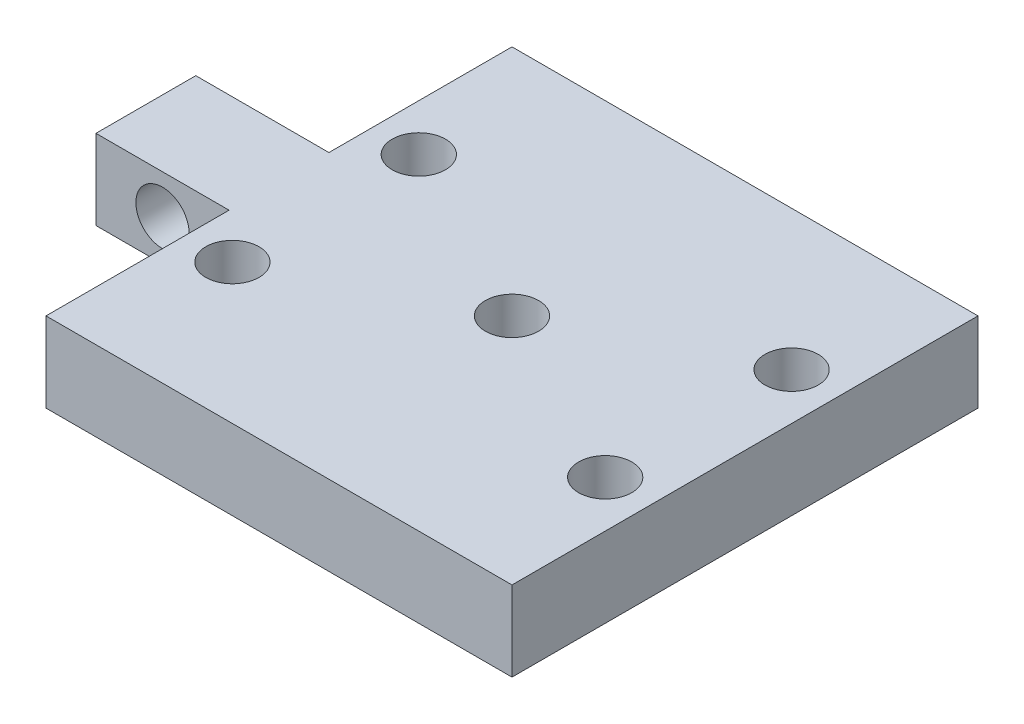
ISO-10303-21;
HEADER;
FILE_DESCRIPTION(('STEP AP214'),'2;1');
FILE_NAME('part.step','',(''),(''),'','','');
FILE_SCHEMA(('AUTOMOTIVE_DESIGN { 1 0 10303 214 1 1 1 1 }'));
ENDSEC;
DATA;
#1=APPLICATION_CONTEXT('core data for automotive mechanical design processes');
#2=APPLICATION_PROTOCOL_DEFINITION('international standard','automotive_design',2000,#1);
#3=PRODUCT_CONTEXT('',#1,'mechanical');
#4=PRODUCT('Part','Part','',(#3));
#5=PRODUCT_RELATED_PRODUCT_CATEGORY('part','',(#4));
#6=PRODUCT_DEFINITION_FORMATION('','',#4);
#7=PRODUCT_DEFINITION_CONTEXT('part definition',#1,'design');
#8=PRODUCT_DEFINITION('design','',#6,#7);
#9=PRODUCT_DEFINITION_SHAPE('','',#8);
#10=(LENGTH_UNIT() NAMED_UNIT(*) SI_UNIT(.MILLI.,.METRE.));
#11=(NAMED_UNIT(*) PLANE_ANGLE_UNIT() SI_UNIT($,.RADIAN.));
#12=(NAMED_UNIT(*) SI_UNIT($,.STERADIAN.) SOLID_ANGLE_UNIT());
#13=UNCERTAINTY_MEASURE_WITH_UNIT(LENGTH_MEASURE(1.E-05),#10,'distance_accuracy_value','');
#14=(GEOMETRIC_REPRESENTATION_CONTEXT(3) GLOBAL_UNCERTAINTY_ASSIGNED_CONTEXT((#13)) GLOBAL_UNIT_ASSIGNED_CONTEXT((#10,
#11,#12)) REPRESENTATION_CONTEXT('',''));
#15=CARTESIAN_POINT('',(0.,0.,0.));
#16=DIRECTION('',(0.,0.,1.));
#17=DIRECTION('',(1.,0.,0.));
#18=AXIS2_PLACEMENT_3D('',#15,#16,#17);
#19=CARTESIAN_POINT('',(-35.,12.,35.));
#20=DIRECTION('',(1.,0.,0.));
#21=DIRECTION('',(0.,0.,-1.));
#22=AXIS2_PLACEMENT_3D('',#19,#20,#21);
#23=PLANE('',#22);
#24=DIRECTION('',(0.,0.,1.));
#25=VECTOR('',#24,1.);
#26=CARTESIAN_POINT('',(-35.,0.,35.));
#27=LINE('',#26,#25);
#28=CARTESIAN_POINT('',(-35.,0.,-35.));
#29=VERTEX_POINT('',#28);
#30=CARTESIAN_POINT('',(-35.,0.,-7.5));
#31=VERTEX_POINT('',#30);
#32=EDGE_CURVE('E201',#29,#31,#27,.T.);
#33=ORIENTED_EDGE('',*,*,#32,.T.);
#34=DIRECTION('',(0.,1.,0.));
#35=VECTOR('',#34,1.);
#36=CARTESIAN_POINT('',(-35.,12.,-7.5));
#37=LINE('',#36,#35);
#38=CARTESIAN_POINT('',(-35.,12.,-7.5));
#39=VERTEX_POINT('',#38);
#40=EDGE_CURVE('E11',#31,#39,#37,.T.);
#41=ORIENTED_EDGE('',*,*,#40,.T.);
#42=DIRECTION('',(0.,0.,1.));
#43=VECTOR('',#42,1.);
#44=CARTESIAN_POINT('',(-35.,12.,35.));
#45=LINE('',#44,#43);
#46=CARTESIAN_POINT('',(-35.,12.,-35.));
#47=VERTEX_POINT('',#46);
#48=EDGE_CURVE('E187',#47,#39,#45,.T.);
#49=ORIENTED_EDGE('',*,*,#48,.F.);
#50=DIRECTION('',(0.,-1.,0.));
#51=VECTOR('',#50,1.);
#52=CARTESIAN_POINT('',(-35.,12.,-35.));
#53=LINE('',#52,#51);
#54=EDGE_CURVE('E211',#47,#29,#53,.T.);
#55=ORIENTED_EDGE('',*,*,#54,.T.);
#56=EDGE_LOOP('',(#33,#41,#49,#55));
#57=FACE_BOUND('',#56,.T.);
#58=ADVANCED_FACE('F38',(#57),#23,.F.);
#59=CARTESIAN_POINT('',(0.,12.,0.));
#60=DIRECTION('',(0.,-1.,0.));
#61=DIRECTION('',(0.,0.,-1.));
#62=AXIS2_PLACEMENT_3D('',#59,#60,#61);
#63=PLANE('',#62);
#64=CARTESIAN_POINT('',(-28.,12.,14.));
#65=DIRECTION('',(0.,1.,0.));
#66=DIRECTION('',(0.,0.,1.));
#67=AXIS2_PLACEMENT_3D('',#64,#65,#66);
#68=CIRCLE('',#67,4.);
#69=CARTESIAN_POINT('',(-28.,12.,18.));
#70=VERTEX_POINT('',#69);
#71=EDGE_CURVE('E153',#70,#70,#68,.T.);
#72=ORIENTED_EDGE('',*,*,#71,.F.);
#73=EDGE_LOOP('',(#72));
#74=FACE_BOUND('',#73,.T.);
#75=CARTESIAN_POINT('',(28.,12.,14.));
#76=DIRECTION('',(0.,1.,0.));
#77=DIRECTION('',(0.,0.,1.));
#78=AXIS2_PLACEMENT_3D('',#75,#76,#77);
#79=CIRCLE('',#78,4.);
#80=CARTESIAN_POINT('',(28.,12.,18.));
#81=VERTEX_POINT('',#80);
#82=EDGE_CURVE('E160',#81,#81,#79,.T.);
#83=ORIENTED_EDGE('',*,*,#82,.F.);
#84=EDGE_LOOP('',(#83));
#85=FACE_BOUND('',#84,.T.);
#86=CARTESIAN_POINT('',(28.,12.,-14.));
#87=DIRECTION('',(0.,1.,0.));
#88=DIRECTION('',(0.,0.,1.));
#89=AXIS2_PLACEMENT_3D('',#86,#87,#88);
#90=CIRCLE('',#89,4.);
#91=CARTESIAN_POINT('',(28.,12.,-10.));
#92=VERTEX_POINT('',#91);
#93=EDGE_CURVE('E155',#92,#92,#90,.T.);
#94=ORIENTED_EDGE('',*,*,#93,.F.);
#95=EDGE_LOOP('',(#94));
#96=FACE_BOUND('',#95,.T.);
#97=CARTESIAN_POINT('',(-28.,12.,-14.));
#98=DIRECTION('',(0.,1.,0.));
#99=DIRECTION('',(0.,0.,1.));
#100=AXIS2_PLACEMENT_3D('',#97,#98,#99);
#101=CIRCLE('',#100,4.);
#102=CARTESIAN_POINT('',(-28.,12.,-10.));
#103=VERTEX_POINT('',#102);
#104=EDGE_CURVE('E159',#103,#103,#101,.T.);
#105=ORIENTED_EDGE('',*,*,#104,.F.);
#106=EDGE_LOOP('',(#105));
#107=FACE_BOUND('',#106,.T.);
#108=ORIENTED_EDGE('',*,*,#48,.T.);
#109=DIRECTION('',(-1.,0.,0.));
#110=VECTOR('',#109,1.);
#111=CARTESIAN_POINT('',(-15.,12.,-7.5));
#112=LINE('',#111,#110);
#113=CARTESIAN_POINT('',(-55.,12.,-7.49999999999999));
#114=VERTEX_POINT('',#113);
#115=EDGE_CURVE('E144',#39,#114,#112,.T.);
#116=ORIENTED_EDGE('',*,*,#115,.T.);
#117=DIRECTION('',(0.,0.,1.));
#118=VECTOR('',#117,1.);
#119=CARTESIAN_POINT('',(-55.,12.,-7.49999999999999));
#120=LINE('',#119,#118);
#121=CARTESIAN_POINT('',(-55.,12.,7.49999999999999));
#122=VERTEX_POINT('',#121);
#123=EDGE_CURVE('E129',#114,#122,#120,.T.);
#124=ORIENTED_EDGE('',*,*,#123,.T.);
#125=DIRECTION('',(1.,0.,0.));
#126=VECTOR('',#125,1.);
#127=CARTESIAN_POINT('',(-55.,12.,7.49999999999999));
#128=LINE('',#127,#126);
#129=CARTESIAN_POINT('',(-35.,12.,7.5));
#130=VERTEX_POINT('',#129);
#131=EDGE_CURVE('E54',#122,#130,#128,.T.);
#132=ORIENTED_EDGE('',*,*,#131,.T.);
#133=CARTESIAN_POINT('',(-35.,12.,35.));
#134=VERTEX_POINT('',#133);
#135=EDGE_CURVE('E186',#130,#134,#45,.T.);
#136=ORIENTED_EDGE('',*,*,#135,.T.);
#137=DIRECTION('',(1.,0.,0.));
#138=VECTOR('',#137,1.);
#139=CARTESIAN_POINT('',(-35.,12.,35.));
#140=LINE('',#139,#138);
#141=CARTESIAN_POINT('',(35.,12.,35.));
#142=VERTEX_POINT('',#141);
#143=EDGE_CURVE('E61',#134,#142,#140,.T.);
#144=ORIENTED_EDGE('',*,*,#143,.T.);
#145=DIRECTION('',(0.,0.,-1.));
#146=VECTOR('',#145,1.);
#147=CARTESIAN_POINT('',(35.,12.,35.));
#148=LINE('',#147,#146);
#149=CARTESIAN_POINT('',(35.,12.,-35.));
#150=VERTEX_POINT('',#149);
#151=EDGE_CURVE('E181',#142,#150,#148,.T.);
#152=ORIENTED_EDGE('',*,*,#151,.T.);
#153=DIRECTION('',(-1.,0.,0.));
#154=VECTOR('',#153,1.);
#155=CARTESIAN_POINT('',(-35.,12.,-35.));
#156=LINE('',#155,#154);
#157=EDGE_CURVE('E90',#150,#47,#156,.T.);
#158=ORIENTED_EDGE('',*,*,#157,.T.);
#159=EDGE_LOOP('',(#108,#116,#124,#132,#136,#144,#152,#158));
#160=FACE_BOUND('',#159,.T.);
#161=CARTESIAN_POINT('',(0.,12.,0.));
#162=DIRECTION('',(0.,1.,0.));
#163=DIRECTION('',(0.,0.,1.));
#164=AXIS2_PLACEMENT_3D('',#161,#162,#163);
#165=CIRCLE('',#164,4.);
#166=CARTESIAN_POINT('',(0.,12.,4.));
#167=VERTEX_POINT('',#166);
#168=EDGE_CURVE('E171',#167,#167,#165,.T.);
#169=ORIENTED_EDGE('',*,*,#168,.F.);
#170=EDGE_LOOP('',(#169));
#171=FACE_BOUND('',#170,.T.);
#172=ADVANCED_FACE('F241',(#74,#85,#96,#107,#160,#171),#63,.F.);
#173=CARTESIAN_POINT('',(0.,0.,0.));
#174=DIRECTION('',(0.,-1.,0.));
#175=DIRECTION('',(0.,0.,-1.));
#176=AXIS2_PLACEMENT_3D('',#173,#174,#175);
#177=PLANE('',#176);
#178=DIRECTION('',(-1.,0.,0.));
#179=VECTOR('',#178,1.);
#180=CARTESIAN_POINT('',(-15.,0.,-7.5));
#181=LINE('',#180,#179);
#182=CARTESIAN_POINT('',(-55.,0.,-7.49999999999999));
#183=VERTEX_POINT('',#182);
#184=EDGE_CURVE('E114',#31,#183,#181,.T.);
#185=ORIENTED_EDGE('',*,*,#184,.F.);
#186=ORIENTED_EDGE('',*,*,#32,.F.);
#187=DIRECTION('',(-1.,0.,0.));
#188=VECTOR('',#187,1.);
#189=CARTESIAN_POINT('',(-35.,0.,-35.));
#190=LINE('',#189,#188);
#191=CARTESIAN_POINT('',(35.,0.,-35.));
#192=VERTEX_POINT('',#191);
#193=EDGE_CURVE('E197',#192,#29,#190,.T.);
#194=ORIENTED_EDGE('',*,*,#193,.F.);
#195=DIRECTION('',(0.,0.,-1.));
#196=VECTOR('',#195,1.);
#197=CARTESIAN_POINT('',(35.,0.,35.));
#198=LINE('',#197,#196);
#199=CARTESIAN_POINT('',(35.,0.,35.));
#200=VERTEX_POINT('',#199);
#201=EDGE_CURVE('E175',#200,#192,#198,.T.);
#202=ORIENTED_EDGE('',*,*,#201,.F.);
#203=DIRECTION('',(1.,0.,0.));
#204=VECTOR('',#203,1.);
#205=CARTESIAN_POINT('',(-35.,0.,35.));
#206=LINE('',#205,#204);
#207=CARTESIAN_POINT('',(-35.,0.,35.));
#208=VERTEX_POINT('',#207);
#209=EDGE_CURVE('E82',#208,#200,#206,.T.);
#210=ORIENTED_EDGE('',*,*,#209,.F.);
#211=CARTESIAN_POINT('',(-35.,0.,7.5));
#212=VERTEX_POINT('',#211);
#213=EDGE_CURVE('E200',#212,#208,#27,.T.);
#214=ORIENTED_EDGE('',*,*,#213,.F.);
#215=DIRECTION('',(1.,0.,0.));
#216=VECTOR('',#215,1.);
#217=CARTESIAN_POINT('',(-55.,0.,7.49999999999999));
#218=LINE('',#217,#216);
#219=CARTESIAN_POINT('',(-55.,0.,7.49999999999999));
#220=VERTEX_POINT('',#219);
#221=EDGE_CURVE('E132',#220,#212,#218,.T.);
#222=ORIENTED_EDGE('',*,*,#221,.F.);
#223=DIRECTION('',(0.,0.,1.));
#224=VECTOR('',#223,1.);
#225=CARTESIAN_POINT('',(-55.,0.,-7.49999999999999));
#226=LINE('',#225,#224);
#227=EDGE_CURVE('E124',#183,#220,#226,.T.);
#228=ORIENTED_EDGE('',*,*,#227,.F.);
#229=EDGE_LOOP('',(#185,#186,#194,#202,#210,#214,#222,#228));
#230=FACE_BOUND('',#229,.T.);
#231=CARTESIAN_POINT('',(-28.,0.,14.));
#232=DIRECTION('',(0.,-1.,0.));
#233=DIRECTION('',(0.,0.,-1.));
#234=AXIS2_PLACEMENT_3D('',#231,#232,#233);
#235=CIRCLE('',#234,4.);
#236=CARTESIAN_POINT('',(-28.,0.,10.));
#237=VERTEX_POINT('',#236);
#238=EDGE_CURVE('E180',#237,#237,#235,.T.);
#239=ORIENTED_EDGE('',*,*,#238,.F.);
#240=EDGE_LOOP('',(#239));
#241=FACE_BOUND('',#240,.T.);
#242=CARTESIAN_POINT('',(28.,0.,14.));
#243=DIRECTION('',(0.,-1.,0.));
#244=DIRECTION('',(0.,0.,-1.));
#245=AXIS2_PLACEMENT_3D('',#242,#243,#244);
#246=CIRCLE('',#245,4.);
#247=CARTESIAN_POINT('',(28.,0.,10.));
#248=VERTEX_POINT('',#247);
#249=EDGE_CURVE('E225',#248,#248,#246,.T.);
#250=ORIENTED_EDGE('',*,*,#249,.F.);
#251=EDGE_LOOP('',(#250));
#252=FACE_BOUND('',#251,.T.);
#253=CARTESIAN_POINT('',(28.,0.,-14.));
#254=DIRECTION('',(0.,-1.,0.));
#255=DIRECTION('',(0.,0.,-1.));
#256=AXIS2_PLACEMENT_3D('',#253,#254,#255);
#257=CIRCLE('',#256,4.);
#258=CARTESIAN_POINT('',(28.,0.,-18.));
#259=VERTEX_POINT('',#258);
#260=EDGE_CURVE('E221',#259,#259,#257,.T.);
#261=ORIENTED_EDGE('',*,*,#260,.F.);
#262=EDGE_LOOP('',(#261));
#263=FACE_BOUND('',#262,.T.);
#264=CARTESIAN_POINT('',(-28.,0.,-14.));
#265=DIRECTION('',(0.,-1.,0.));
#266=DIRECTION('',(0.,0.,-1.));
#267=AXIS2_PLACEMENT_3D('',#264,#265,#266);
#268=CIRCLE('',#267,4.);
#269=CARTESIAN_POINT('',(-28.,0.,-18.));
#270=VERTEX_POINT('',#269);
#271=EDGE_CURVE('E170',#270,#270,#268,.T.);
#272=ORIENTED_EDGE('',*,*,#271,.F.);
#273=EDGE_LOOP('',(#272));
#274=FACE_BOUND('',#273,.T.);
#275=CARTESIAN_POINT('',(0.,0.,0.));
#276=DIRECTION('',(0.,1.,0.));
#277=DIRECTION('',(0.,0.,1.));
#278=AXIS2_PLACEMENT_3D('',#275,#276,#277);
#279=CIRCLE('',#278,4.);
#280=CARTESIAN_POINT('',(0.,0.,4.));
#281=VERTEX_POINT('',#280);
#282=EDGE_CURVE('E176',#281,#281,#279,.T.);
#283=ORIENTED_EDGE('',*,*,#282,.T.);
#284=EDGE_LOOP('',(#283));
#285=FACE_BOUND('',#284,.T.);
#286=ADVANCED_FACE('F135',(#230,#241,#252,#263,#274,#285),#177,.T.);
#287=CARTESIAN_POINT('',(35.,12.,35.));
#288=DIRECTION('',(-1.,0.,0.));
#289=DIRECTION('',(0.,0.,1.));
#290=AXIS2_PLACEMENT_3D('',#287,#288,#289);
#291=PLANE('',#290);
#292=ORIENTED_EDGE('',*,*,#201,.T.);
#293=DIRECTION('',(0.,-1.,0.));
#294=VECTOR('',#293,1.);
#295=CARTESIAN_POINT('',(35.,12.,-35.));
#296=LINE('',#295,#294);
#297=EDGE_CURVE('E215',#150,#192,#296,.T.);
#298=ORIENTED_EDGE('',*,*,#297,.F.);
#299=ORIENTED_EDGE('',*,*,#151,.F.);
#300=DIRECTION('',(0.,-1.,0.));
#301=VECTOR('',#300,1.);
#302=CARTESIAN_POINT('',(35.,12.,35.));
#303=LINE('',#302,#301);
#304=EDGE_CURVE('E193',#142,#200,#303,.T.);
#305=ORIENTED_EDGE('',*,*,#304,.T.);
#306=EDGE_LOOP('',(#292,#298,#299,#305));
#307=FACE_BOUND('',#306,.T.);
#308=ADVANCED_FACE('F40',(#307),#291,.F.);
#309=CARTESIAN_POINT('',(-35.,12.,-35.));
#310=DIRECTION('',(0.,0.,1.));
#311=DIRECTION('',(1.,0.,0.));
#312=AXIS2_PLACEMENT_3D('',#309,#310,#311);
#313=PLANE('',#312);
#314=ORIENTED_EDGE('',*,*,#193,.T.);
#315=ORIENTED_EDGE('',*,*,#54,.F.);
#316=ORIENTED_EDGE('',*,*,#157,.F.);
#317=ORIENTED_EDGE('',*,*,#297,.T.);
#318=EDGE_LOOP('',(#314,#315,#316,#317));
#319=FACE_BOUND('',#318,.T.);
#320=ADVANCED_FACE('F248',(#319),#313,.F.);
#321=ORIENTED_EDGE('',*,*,#135,.F.);
#322=DIRECTION('',(0.,-1.,0.));
#323=VECTOR('',#322,1.);
#324=CARTESIAN_POINT('',(-35.,12.,7.5));
#325=LINE('',#324,#323);
#326=EDGE_CURVE('E47',#130,#212,#325,.T.);
#327=ORIENTED_EDGE('',*,*,#326,.T.);
#328=ORIENTED_EDGE('',*,*,#213,.T.);
#329=DIRECTION('',(0.,-1.,0.));
#330=VECTOR('',#329,1.);
#331=CARTESIAN_POINT('',(-35.,12.,35.));
#332=LINE('',#331,#330);
#333=EDGE_CURVE('E208',#134,#208,#332,.T.);
#334=ORIENTED_EDGE('',*,*,#333,.F.);
#335=EDGE_LOOP('',(#321,#327,#328,#334));
#336=FACE_BOUND('',#335,.T.);
#337=ADVANCED_FACE('F235',(#336),#23,.F.);
#338=CARTESIAN_POINT('',(-35.,12.,35.));
#339=DIRECTION('',(0.,0.,-1.));
#340=DIRECTION('',(-1.,0.,0.));
#341=AXIS2_PLACEMENT_3D('',#338,#339,#340);
#342=PLANE('',#341);
#343=ORIENTED_EDGE('',*,*,#209,.T.);
#344=ORIENTED_EDGE('',*,*,#304,.F.);
#345=ORIENTED_EDGE('',*,*,#143,.F.);
#346=ORIENTED_EDGE('',*,*,#333,.T.);
#347=EDGE_LOOP('',(#343,#344,#345,#346));
#348=FACE_BOUND('',#347,.T.);
#349=ADVANCED_FACE('F243',(#348),#342,.F.);
#350=CARTESIAN_POINT('',(0.,12.,0.));
#351=DIRECTION('',(0.,-1.,0.));
#352=DIRECTION('',(0.,0.,-1.));
#353=AXIS2_PLACEMENT_3D('',#350,#351,#352);
#354=CYLINDRICAL_SURFACE('',#353,4.);
#355=ORIENTED_EDGE('',*,*,#168,.T.);
#356=EDGE_LOOP('',(#355));
#357=FACE_BOUND('',#356,.T.);
#358=ORIENTED_EDGE('',*,*,#282,.F.);
#359=EDGE_LOOP('',(#358));
#360=FACE_BOUND('',#359,.T.);
#361=ADVANCED_FACE('F263',(#357,#360),#354,.F.);
#362=CARTESIAN_POINT('',(-28.,-3.,-14.));
#363=DIRECTION('',(0.,1.,0.));
#364=DIRECTION('',(0.,0.,1.));
#365=AXIS2_PLACEMENT_3D('',#362,#363,#364);
#366=CYLINDRICAL_SURFACE('',#365,4.);
#367=ORIENTED_EDGE('',*,*,#271,.T.);
#368=EDGE_LOOP('',(#367));
#369=FACE_BOUND('',#368,.T.);
#370=ORIENTED_EDGE('',*,*,#104,.T.);
#371=EDGE_LOOP('',(#370));
#372=FACE_BOUND('',#371,.T.);
#373=ADVANCED_FACE('F276',(#369,#372),#366,.F.);
#374=CARTESIAN_POINT('',(28.,-3.,-14.));
#375=DIRECTION('',(0.,1.,0.));
#376=DIRECTION('',(0.,0.,1.));
#377=AXIS2_PLACEMENT_3D('',#374,#375,#376);
#378=CYLINDRICAL_SURFACE('',#377,4.);
#379=ORIENTED_EDGE('',*,*,#260,.T.);
#380=EDGE_LOOP('',(#379));
#381=FACE_BOUND('',#380,.T.);
#382=ORIENTED_EDGE('',*,*,#93,.T.);
#383=EDGE_LOOP('',(#382));
#384=FACE_BOUND('',#383,.T.);
#385=ADVANCED_FACE('F280',(#381,#384),#378,.F.);
#386=CARTESIAN_POINT('',(28.,-3.,14.));
#387=DIRECTION('',(0.,1.,0.));
#388=DIRECTION('',(0.,0.,1.));
#389=AXIS2_PLACEMENT_3D('',#386,#387,#388);
#390=CYLINDRICAL_SURFACE('',#389,4.);
#391=ORIENTED_EDGE('',*,*,#249,.T.);
#392=EDGE_LOOP('',(#391));
#393=FACE_BOUND('',#392,.T.);
#394=ORIENTED_EDGE('',*,*,#82,.T.);
#395=EDGE_LOOP('',(#394));
#396=FACE_BOUND('',#395,.T.);
#397=ADVANCED_FACE('F285',(#393,#396),#390,.F.);
#398=CARTESIAN_POINT('',(-28.,-3.,14.));
#399=DIRECTION('',(0.,1.,0.));
#400=DIRECTION('',(0.,0.,1.));
#401=AXIS2_PLACEMENT_3D('',#398,#399,#400);
#402=CYLINDRICAL_SURFACE('',#401,4.);
#403=ORIENTED_EDGE('',*,*,#238,.T.);
#404=EDGE_LOOP('',(#403));
#405=FACE_BOUND('',#404,.T.);
#406=ORIENTED_EDGE('',*,*,#71,.T.);
#407=EDGE_LOOP('',(#406));
#408=FACE_BOUND('',#407,.T.);
#409=ADVANCED_FACE('F282',(#405,#408),#402,.F.);
#410=CARTESIAN_POINT('',(-15.,0.,-7.5));
#411=DIRECTION('',(0.,0.,-1.));
#412=DIRECTION('',(-1.,0.,0.));
#413=AXIS2_PLACEMENT_3D('',#410,#411,#412);
#414=PLANE('',#413);
#415=CARTESIAN_POINT('',(-45.,6.,-7.5));
#416=DIRECTION('',(0.,0.,-1.));
#417=DIRECTION('',(-1.,0.,0.));
#418=AXIS2_PLACEMENT_3D('',#415,#416,#417);
#419=CIRCLE('',#418,4.00000000000001);
#420=CARTESIAN_POINT('',(-49.,6.,-7.5));
#421=VERTEX_POINT('',#420);
#422=EDGE_CURVE('E147',#421,#421,#419,.F.);
#423=ORIENTED_EDGE('',*,*,#422,.T.);
#424=EDGE_LOOP('',(#423));
#425=FACE_BOUND('',#424,.T.);
#426=ORIENTED_EDGE('',*,*,#40,.F.);
#427=ORIENTED_EDGE('',*,*,#184,.T.);
#428=DIRECTION('',(0.,1.,0.));
#429=VECTOR('',#428,1.);
#430=CARTESIAN_POINT('',(-55.,0.,-7.49999999999999));
#431=LINE('',#430,#429);
#432=EDGE_CURVE('E117',#183,#114,#431,.T.);
#433=ORIENTED_EDGE('',*,*,#432,.T.);
#434=ORIENTED_EDGE('',*,*,#115,.F.);
#435=EDGE_LOOP('',(#426,#427,#433,#434));
#436=FACE_BOUND('',#435,.T.);
#437=ADVANCED_FACE('F116',(#425,#436),#414,.T.);
#438=CARTESIAN_POINT('',(-55.,0.,7.49999999999999));
#439=DIRECTION('',(0.,0.,1.));
#440=DIRECTION('',(1.,0.,0.));
#441=AXIS2_PLACEMENT_3D('',#438,#439,#440);
#442=PLANE('',#441);
#443=CARTESIAN_POINT('',(-45.,6.,7.5));
#444=DIRECTION('',(0.,0.,1.));
#445=DIRECTION('',(1.,0.,0.));
#446=AXIS2_PLACEMENT_3D('',#443,#444,#445);
#447=CIRCLE('',#446,4.00000000000001);
#448=CARTESIAN_POINT('',(-41.,6.,7.5));
#449=VERTEX_POINT('',#448);
#450=EDGE_CURVE('E310',#449,#449,#447,.T.);
#451=ORIENTED_EDGE('',*,*,#450,.F.);
#452=EDGE_LOOP('',(#451));
#453=FACE_BOUND('',#452,.T.);
#454=ORIENTED_EDGE('',*,*,#326,.F.);
#455=ORIENTED_EDGE('',*,*,#131,.F.);
#456=DIRECTION('',(0.,1.,0.));
#457=VECTOR('',#456,1.);
#458=CARTESIAN_POINT('',(-55.,0.,7.49999999999999));
#459=LINE('',#458,#457);
#460=EDGE_CURVE('E131',#220,#122,#459,.T.);
#461=ORIENTED_EDGE('',*,*,#460,.F.);
#462=ORIENTED_EDGE('',*,*,#221,.T.);
#463=EDGE_LOOP('',(#454,#455,#461,#462));
#464=FACE_BOUND('',#463,.T.);
#465=ADVANCED_FACE('F295',(#453,#464),#442,.T.);
#466=CARTESIAN_POINT('',(-55.,0.,-7.49999999999999));
#467=DIRECTION('',(-1.,0.,0.));
#468=DIRECTION('',(0.,0.,1.));
#469=AXIS2_PLACEMENT_3D('',#466,#467,#468);
#470=PLANE('',#469);
#471=ORIENTED_EDGE('',*,*,#123,.F.);
#472=ORIENTED_EDGE('',*,*,#432,.F.);
#473=ORIENTED_EDGE('',*,*,#227,.T.);
#474=ORIENTED_EDGE('',*,*,#460,.T.);
#475=EDGE_LOOP('',(#471,#472,#473,#474));
#476=FACE_BOUND('',#475,.T.);
#477=ADVANCED_FACE('F128',(#476),#470,.T.);
#478=CARTESIAN_POINT('',(-45.,6.,-18.8137084989848));
#479=DIRECTION('',(0.,0.,1.));
#480=DIRECTION('',(1.,0.,0.));
#481=AXIS2_PLACEMENT_3D('',#478,#479,#480);
#482=CYLINDRICAL_SURFACE('',#481,4.00000000000001);
#483=ORIENTED_EDGE('',*,*,#450,.T.);
#484=EDGE_LOOP('',(#483));
#485=FACE_BOUND('',#484,.T.);
#486=ORIENTED_EDGE('',*,*,#422,.F.);
#487=EDGE_LOOP('',(#486));
#488=FACE_BOUND('',#487,.T.);
#489=ADVANCED_FACE('F299',(#485,#488),#482,.F.);
#490=CLOSED_SHELL('',(#58,#172,#286,#308,#320,#337,#349,#361,#373,#385,#397,#409,#437,#465,#477,#489));
#491=MANIFOLD_SOLID_BREP('B2',#490);
#492=ADVANCED_BREP_SHAPE_REPRESENTATION('',(#18,#491),#14);
#493=SHAPE_DEFINITION_REPRESENTATION(#9,#492);
ENDSEC;
END-ISO-10303-21;
